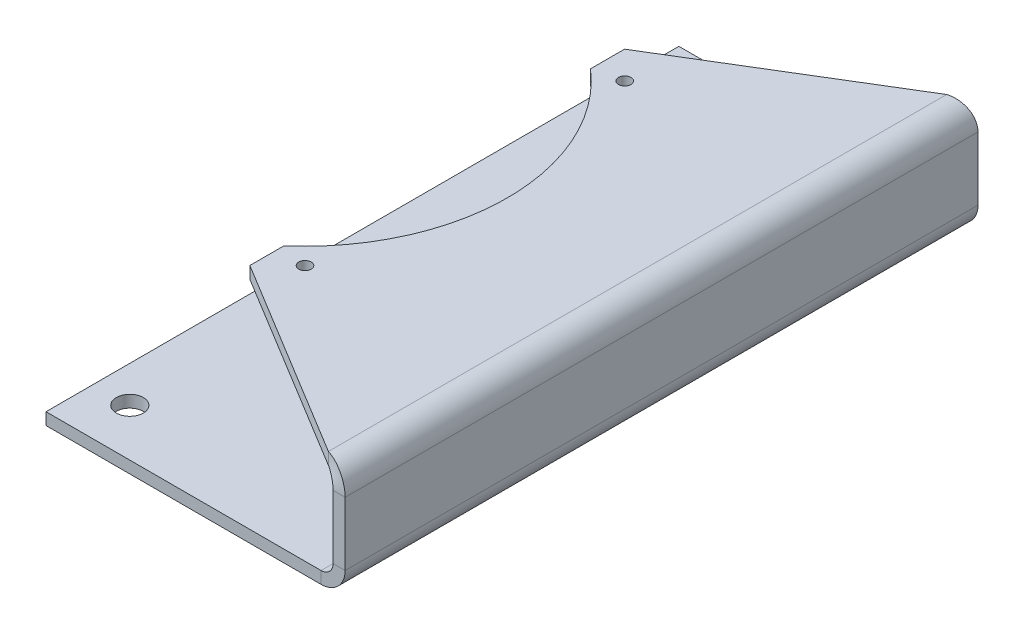
ISO-10303-21;
HEADER;
FILE_DESCRIPTION(('STEP AP214'),'2;1');
FILE_NAME('part.step','',(''),(''),'','','');
FILE_SCHEMA(('AUTOMOTIVE_DESIGN { 1 0 10303 214 1 1 1 1 }'));
ENDSEC;
DATA;
#1=APPLICATION_CONTEXT('core data for automotive mechanical design processes');
#2=APPLICATION_PROTOCOL_DEFINITION('international standard','automotive_design',2000,#1);
#3=PRODUCT_CONTEXT('',#1,'mechanical');
#4=PRODUCT('Part','Part','',(#3));
#5=PRODUCT_RELATED_PRODUCT_CATEGORY('part','',(#4));
#6=PRODUCT_DEFINITION_FORMATION('','',#4);
#7=PRODUCT_DEFINITION_CONTEXT('part definition',#1,'design');
#8=PRODUCT_DEFINITION('design','',#6,#7);
#9=PRODUCT_DEFINITION_SHAPE('','',#8);
#10=(LENGTH_UNIT() NAMED_UNIT(*) SI_UNIT(.MILLI.,.METRE.));
#11=(NAMED_UNIT(*) PLANE_ANGLE_UNIT() SI_UNIT($,.RADIAN.));
#12=(NAMED_UNIT(*) SI_UNIT($,.STERADIAN.) SOLID_ANGLE_UNIT());
#13=UNCERTAINTY_MEASURE_WITH_UNIT(LENGTH_MEASURE(1.E-05),#10,'distance_accuracy_value','');
#14=(GEOMETRIC_REPRESENTATION_CONTEXT(3) GLOBAL_UNCERTAINTY_ASSIGNED_CONTEXT((#13)) GLOBAL_UNIT_ASSIGNED_CONTEXT((#10,
#11,#12)) REPRESENTATION_CONTEXT('',''));
#15=CARTESIAN_POINT('',(0.,0.,0.));
#16=DIRECTION('',(0.,0.,1.));
#17=DIRECTION('',(1.,0.,0.));
#18=AXIS2_PLACEMENT_3D('',#15,#16,#17);
#19=CARTESIAN_POINT('',(381.03809354639,358.924087180332,-231.441727253866));
#20=DIRECTION('',(0.,0.,1.));
#21=DIRECTION('',(0.,-1.,0.));
#22=AXIS2_PLACEMENT_3D('',#19,#20,#21);
#23=PLANE('',#22);
#24=DIRECTION('',(-1.,0.,0.));
#25=VECTOR('',#24,1.);
#26=CARTESIAN_POINT('',(381.03809354639,42.3046070548638,-231.441727253866));
#27=LINE('',#26,#25);
#28=CARTESIAN_POINT('',(386.82809354639,42.3046070548638,-231.441727253866));
#29=VERTEX_POINT('',#28);
#30=CARTESIAN_POINT('',(381.03809354639,42.3046070548638,-231.441727253866));
#31=VERTEX_POINT('',#30);
#32=EDGE_CURVE('E11',#29,#31,#27,.T.);
#33=ORIENTED_EDGE('',*,*,#32,.F.);
#34=DIRECTION('',(0.,1.,0.));
#35=VECTOR('',#34,1.);
#36=CARTESIAN_POINT('',(386.82809354639,358.924087180332,-231.441727253866));
#37=LINE('',#36,#35);
#38=CARTESIAN_POINT('',(386.82809354639,11.761000104,-231.441727253866));
#39=VERTEX_POINT('',#38);
#40=EDGE_CURVE('E103',#29,#39,#37,.F.);
#41=ORIENTED_EDGE('',*,*,#40,.T.);
#42=DIRECTION('',(-1.,0.,0.));
#43=VECTOR('',#42,1.);
#44=CARTESIAN_POINT('',(381.03809354639,11.761000104,-231.441727253866));
#45=LINE('',#44,#43);
#46=CARTESIAN_POINT('',(381.03809354639,11.761000104,-231.441727253866));
#47=VERTEX_POINT('',#46);
#48=EDGE_CURVE('E45',#39,#47,#45,.T.);
#49=ORIENTED_EDGE('',*,*,#48,.T.);
#50=DIRECTION('',(0.,-1.,0.));
#51=VECTOR('',#50,1.);
#52=CARTESIAN_POINT('',(381.03809354639,358.924087180332,-231.441727253866));
#53=LINE('',#52,#51);
#54=EDGE_CURVE('E106',#31,#47,#53,.T.);
#55=ORIENTED_EDGE('',*,*,#54,.F.);
#56=EDGE_LOOP('',(#33,#41,#49,#55));
#57=FACE_BOUND('',#56,.T.);
#58=ADVANCED_FACE('F35',(#57),#23,.F.);
#59=CARTESIAN_POINT('',(375.24809344239,11.761000104,-231.441727253866));
#60=DIRECTION('',(0.,0.,-1.));
#61=DIRECTION('',(-1.,0.,0.));
#62=AXIS2_PLACEMENT_3D('',#59,#60,#61);
#63=PLANE('',#62);
#64=ORIENTED_EDGE('',*,*,#48,.F.);
#65=CARTESIAN_POINT('',(375.24809344239,11.761000104,-231.441727253866));
#66=DIRECTION('',(0.,0.,-1.));
#67=DIRECTION('',(-1.,0.,0.));
#68=AXIS2_PLACEMENT_3D('',#65,#66,#67);
#69=CIRCLE('',#68,11.580000104);
#70=CARTESIAN_POINT('',(375.24809344239,0.180999999999997,-231.441727253866));
#71=VERTEX_POINT('',#70);
#72=EDGE_CURVE('E306',#39,#71,#69,.T.);
#73=ORIENTED_EDGE('',*,*,#72,.T.);
#74=DIRECTION('',(0.,1.,0.));
#75=VECTOR('',#74,1.);
#76=CARTESIAN_POINT('',(375.24809344239,5.971,-231.441727253866));
#77=LINE('',#76,#75);
#78=CARTESIAN_POINT('',(375.24809344239,5.971,-231.441727253866));
#79=VERTEX_POINT('',#78);
#80=EDGE_CURVE('E181',#71,#79,#77,.T.);
#81=ORIENTED_EDGE('',*,*,#80,.T.);
#82=CARTESIAN_POINT('',(375.24809344239,11.761000104,-231.441727253866));
#83=DIRECTION('',(0.,0.,1.));
#84=DIRECTION('',(1.,0.,0.));
#85=AXIS2_PLACEMENT_3D('',#82,#83,#84);
#86=CIRCLE('',#85,5.790000104);
#87=EDGE_CURVE('E203',#47,#79,#86,.F.);
#88=ORIENTED_EDGE('',*,*,#87,.F.);
#89=EDGE_LOOP('',(#64,#73,#81,#88));
#90=FACE_BOUND('',#89,.T.);
#91=ADVANCED_FACE('F204',(#90),#63,.T.);
#92=CARTESIAN_POINT('',(242.762611250868,5.971,-231.441727253866));
#93=DIRECTION('',(0.,0.,1.));
#94=DIRECTION('',(-1.,0.,0.));
#95=AXIS2_PLACEMENT_3D('',#92,#93,#94);
#96=PLANE('',#95);
#97=ORIENTED_EDGE('',*,*,#80,.F.);
#98=DIRECTION('',(1.,0.,0.));
#99=VECTOR('',#98,1.);
#100=CARTESIAN_POINT('',(0.,0.181,-231.441727253866));
#101=LINE('',#100,#99);
#102=CARTESIAN_POINT('',(242.762611250868,0.181,-231.441727253866));
#103=VERTEX_POINT('',#102);
#104=EDGE_CURVE('E152',#71,#103,#101,.F.);
#105=ORIENTED_EDGE('',*,*,#104,.T.);
#106=DIRECTION('',(0.,1.,0.));
#107=VECTOR('',#106,1.);
#108=CARTESIAN_POINT('',(242.762611250868,5.971,-231.441727253866));
#109=LINE('',#108,#107);
#110=CARTESIAN_POINT('',(242.762611250868,5.971,-231.441727253866));
#111=VERTEX_POINT('',#110);
#112=EDGE_CURVE('E178',#103,#111,#109,.T.);
#113=ORIENTED_EDGE('',*,*,#112,.T.);
#114=DIRECTION('',(-1.,0.,0.));
#115=VECTOR('',#114,1.);
#116=CARTESIAN_POINT('',(242.762611250868,5.971,-231.441727253866));
#117=LINE('',#116,#115);
#118=EDGE_CURVE('E226',#79,#111,#117,.T.);
#119=ORIENTED_EDGE('',*,*,#118,.F.);
#120=EDGE_LOOP('',(#97,#105,#113,#119));
#121=FACE_BOUND('',#120,.T.);
#122=ADVANCED_FACE('F325',(#121),#96,.F.);
#123=CARTESIAN_POINT('',(242.762611250868,5.971,73.3582727461337));
#124=DIRECTION('',(1.,0.,0.));
#125=DIRECTION('',(0.,0.,1.));
#126=AXIS2_PLACEMENT_3D('',#123,#124,#125);
#127=PLANE('',#126);
#128=ORIENTED_EDGE('',*,*,#112,.F.);
#129=DIRECTION('',(0.,0.,-1.));
#130=VECTOR('',#129,1.);
#131=CARTESIAN_POINT('',(242.762611250868,0.181,0.));
#132=LINE('',#131,#130);
#133=CARTESIAN_POINT('',(242.762611250868,0.181,73.3582727461337));
#134=VERTEX_POINT('',#133);
#135=EDGE_CURVE('E311',#103,#134,#132,.F.);
#136=ORIENTED_EDGE('',*,*,#135,.T.);
#137=DIRECTION('',(0.,1.,0.));
#138=VECTOR('',#137,1.);
#139=CARTESIAN_POINT('',(242.762611250868,5.971,73.3582727461337));
#140=LINE('',#139,#138);
#141=CARTESIAN_POINT('',(242.762611250868,5.971,73.3582727461337));
#142=VERTEX_POINT('',#141);
#143=EDGE_CURVE('E175',#134,#142,#140,.T.);
#144=ORIENTED_EDGE('',*,*,#143,.T.);
#145=DIRECTION('',(0.,0.,1.));
#146=VECTOR('',#145,1.);
#147=CARTESIAN_POINT('',(242.762611250868,5.971,73.3582727461337));
#148=LINE('',#147,#146);
#149=EDGE_CURVE('E229',#111,#142,#148,.T.);
#150=ORIENTED_EDGE('',*,*,#149,.F.);
#151=EDGE_LOOP('',(#128,#136,#144,#150));
#152=FACE_BOUND('',#151,.T.);
#153=ADVANCED_FACE('F437',(#152),#127,.F.);
#154=CARTESIAN_POINT('',(242.762611250868,5.971,73.3582727461337));
#155=DIRECTION('',(0.,0.,-1.));
#156=DIRECTION('',(1.,0.,0.));
#157=AXIS2_PLACEMENT_3D('',#154,#155,#156);
#158=PLANE('',#157);
#159=ORIENTED_EDGE('',*,*,#143,.F.);
#160=DIRECTION('',(1.,0.,0.));
#161=VECTOR('',#160,1.);
#162=CARTESIAN_POINT('',(0.,0.181,73.3582727461337));
#163=LINE('',#162,#161);
#164=CARTESIAN_POINT('',(375.24809344239,0.181,73.3582727461337));
#165=VERTEX_POINT('',#164);
#166=EDGE_CURVE('E288',#134,#165,#163,.T.);
#167=ORIENTED_EDGE('',*,*,#166,.T.);
#168=DIRECTION('',(0.,1.,0.));
#169=VECTOR('',#168,1.);
#170=CARTESIAN_POINT('',(375.24809344239,5.971,73.3582727461337));
#171=LINE('',#170,#169);
#172=CARTESIAN_POINT('',(375.24809344239,5.971,73.3582727461337));
#173=VERTEX_POINT('',#172);
#174=EDGE_CURVE('E172',#165,#173,#171,.T.);
#175=ORIENTED_EDGE('',*,*,#174,.T.);
#176=DIRECTION('',(1.,0.,0.));
#177=VECTOR('',#176,1.);
#178=CARTESIAN_POINT('',(242.762611250868,5.971,73.3582727461337));
#179=LINE('',#178,#177);
#180=EDGE_CURVE('E238',#142,#173,#179,.T.);
#181=ORIENTED_EDGE('',*,*,#180,.F.);
#182=EDGE_LOOP('',(#159,#167,#175,#181));
#183=FACE_BOUND('',#182,.T.);
#184=ADVANCED_FACE('F433',(#183),#158,.F.);
#185=CARTESIAN_POINT('',(375.24809344239,11.761000104,73.3582727461337));
#186=DIRECTION('',(0.,0.,-1.));
#187=DIRECTION('',(-1.,0.,0.));
#188=AXIS2_PLACEMENT_3D('',#185,#186,#187);
#189=PLANE('',#188);
#190=ORIENTED_EDGE('',*,*,#174,.F.);
#191=CARTESIAN_POINT('',(375.24809344239,11.761000104,73.3582727461337));
#192=DIRECTION('',(0.,0.,-1.));
#193=DIRECTION('',(-1.,0.,0.));
#194=AXIS2_PLACEMENT_3D('',#191,#192,#193);
#195=CIRCLE('',#194,11.580000104);
#196=CARTESIAN_POINT('',(386.82809354639,11.761000104,73.3582727461337));
#197=VERTEX_POINT('',#196);
#198=EDGE_CURVE('E140',#165,#197,#195,.F.);
#199=ORIENTED_EDGE('',*,*,#198,.T.);
#200=DIRECTION('',(-1.,0.,0.));
#201=VECTOR('',#200,1.);
#202=CARTESIAN_POINT('',(381.03809354639,11.761000104,73.3582727461337));
#203=LINE('',#202,#201);
#204=CARTESIAN_POINT('',(381.03809354639,11.761000104,73.3582727461337));
#205=VERTEX_POINT('',#204);
#206=EDGE_CURVE('E169',#197,#205,#203,.T.);
#207=ORIENTED_EDGE('',*,*,#206,.T.);
#208=CARTESIAN_POINT('',(375.24809344239,11.761000104,73.3582727461337));
#209=DIRECTION('',(0.,0.,1.));
#210=DIRECTION('',(1.,0.,0.));
#211=AXIS2_PLACEMENT_3D('',#208,#209,#210);
#212=CIRCLE('',#211,5.790000104);
#213=EDGE_CURVE('E208',#173,#205,#212,.T.);
#214=ORIENTED_EDGE('',*,*,#213,.F.);
#215=EDGE_LOOP('',(#190,#199,#207,#214));
#216=FACE_BOUND('',#215,.T.);
#217=ADVANCED_FACE('F430',(#216),#189,.F.);
#218=CARTESIAN_POINT('',(381.03809354639,358.924087180332,73.3582727461337));
#219=DIRECTION('',(0.,0.,1.));
#220=DIRECTION('',(0.,-1.,0.));
#221=AXIS2_PLACEMENT_3D('',#218,#219,#220);
#222=PLANE('',#221);
#223=ORIENTED_EDGE('',*,*,#206,.F.);
#224=DIRECTION('',(0.,1.,0.));
#225=VECTOR('',#224,1.);
#226=CARTESIAN_POINT('',(386.82809354639,358.924087180332,73.3582727461337));
#227=LINE('',#226,#225);
#228=CARTESIAN_POINT('',(386.82809354639,42.3046070548638,73.3582727461337));
#229=VERTEX_POINT('',#228);
#230=EDGE_CURVE('E134',#229,#197,#227,.F.);
#231=ORIENTED_EDGE('',*,*,#230,.F.);
#232=DIRECTION('',(-1.,0.,0.));
#233=VECTOR('',#232,1.);
#234=CARTESIAN_POINT('',(381.03809354639,42.3046070548638,73.3582727461337));
#235=LINE('',#234,#233);
#236=CARTESIAN_POINT('',(381.03809354639,42.3046070548638,73.3582727461337));
#237=VERTEX_POINT('',#236);
#238=EDGE_CURVE('E166',#229,#237,#235,.T.);
#239=ORIENTED_EDGE('',*,*,#238,.T.);
#240=DIRECTION('',(0.,-1.,0.));
#241=VECTOR('',#240,1.);
#242=CARTESIAN_POINT('',(381.03809354639,358.924087180332,73.3582727461337));
#243=LINE('',#242,#241);
#244=EDGE_CURVE('E200',#237,#205,#243,.T.);
#245=ORIENTED_EDGE('',*,*,#244,.T.);
#246=EDGE_LOOP('',(#223,#231,#239,#245));
#247=FACE_BOUND('',#246,.T.);
#248=ADVANCED_FACE('F336',(#247),#222,.T.);
#249=CARTESIAN_POINT('',(363.66809333839,42.3046070548638,66.3180654465985));
#250=CARTESIAN_POINT('',(365.59809333839,42.3046070548638,66.3180654465985));
#251=CARTESIAN_POINT('',(367.52809333839,42.3046070548638,66.3180654465985));
#252=CARTESIAN_POINT('',(369.45809333839,42.3046070548638,66.3180654465985));
#253=CARTESIAN_POINT('',(363.66809333839,19.1446068468638,66.3180654465985));
#254=CARTESIAN_POINT('',(365.59809333839,23.0046068468638,66.3180654465985));
#255=CARTESIAN_POINT('',(367.52809333839,26.8646068468638,66.3180654465985));
#256=CARTESIAN_POINT('',(369.45809333839,30.7246068468638,66.3180654465985));
#257=CARTESIAN_POINT('',(386.82809354639,19.1446068468638,73.3582727461337));
#258=CARTESIAN_POINT('',(384.89809354639,23.0046068468638,73.3582727461337));
#259=CARTESIAN_POINT('',(382.96809354639,26.8646068468638,73.3582727461337));
#260=CARTESIAN_POINT('',(381.03809354639,30.7246068468638,73.3582727461337));
#261=CARTESIAN_POINT('',(386.82809354639,42.3046070548638,73.3582727461337));
#262=CARTESIAN_POINT('',(384.89809354639,42.3046070548638,73.3582727461337));
#263=CARTESIAN_POINT('',(382.96809354639,42.3046070548638,73.3582727461337));
#264=CARTESIAN_POINT('',(381.03809354639,42.3046070548638,73.3582727461337));
#265=CARTESIAN_POINT('',(386.82809354639,65.4646072628638,73.3582727461337));
#266=CARTESIAN_POINT('',(384.89809354639,61.6046072628638,73.3582727461337));
#267=CARTESIAN_POINT('',(382.96809354639,57.7446072628638,73.3582727461337));
#268=CARTESIAN_POINT('',(381.03809354639,53.8846072628638,73.3582727461337));
#269=CARTESIAN_POINT('',(363.66809333839,65.4646072628638,66.3180654465985));
#270=CARTESIAN_POINT('',(365.59809333839,61.6046072628638,66.3180654465985));
#271=CARTESIAN_POINT('',(367.52809333839,57.7446072628638,66.3180654465985));
#272=CARTESIAN_POINT('',(369.45809333839,53.8846072628638,66.3180654465985));
#273=CARTESIAN_POINT('',(363.66809333839,42.3046070548638,66.3180654465985));
#274=CARTESIAN_POINT('',(365.59809333839,42.3046070548638,66.3180654465985));
#275=CARTESIAN_POINT('',(367.52809333839,42.3046070548638,66.3180654465985));
#276=CARTESIAN_POINT('',(369.45809333839,42.3046070548638,66.3180654465985));
#277=(BOUNDED_SURFACE() B_SPLINE_SURFACE(3,3,((#249,#250,#251,#252),(#253,#254,#255,#256),(#257,
#258,#259,#260),(#261,#262,#263,#264),(#265,#266,#267,#268),(#269,#270,#271,#272),(#273,#274,
#275,#276)),.UNSPECIFIED.,.T.,.F.,.F.) B_SPLINE_SURFACE_WITH_KNOTS((4,3,4),(4,4),(0.,0.5,1.),
(0.,1.),.UNSPECIFIED.) GEOMETRIC_REPRESENTATION_ITEM() RATIONAL_B_SPLINE_SURFACE(((1.,1.,1.,1.),
(0.333333333333333,0.333333333333333,0.333333333333333,0.333333333333333),(0.333333333333333,
0.333333333333333,0.333333333333333,0.333333333333333),(1.,1.,1.,1.),(0.333333333333333,
0.333333333333333,0.333333333333333,0.333333333333333),(0.333333333333333,0.333333333333333,
0.333333333333333,0.333333333333333),(1.,1.,1.,1.))) REPRESENTATION_ITEM('') SURFACE());
#278=CARTESIAN_POINT('',(375.24809344239,42.3046070548638,69.8381690963661));
#279=DIRECTION('',(0.290840659168822,0.,-0.956771504056347));
#280=DIRECTION('',(-0.956771504056347,0.,-0.290840659168822));
#281=AXIS2_PLACEMENT_3D('',#278,#279,#280);
#282=ELLIPSE('',#281,12.1032033823177,11.580000104);
#283=CARTESIAN_POINT('',(375.24809344239,53.8846071588638,69.838169096366));
#284=VERTEX_POINT('',#283);
#285=EDGE_CURVE('E121',#229,#284,#282,.F.);
#286=DIRECTION('',(0.,-1.,0.));
#287=VECTOR('',#286,1.);
#288=CARTESIAN_POINT('',(375.24809344239,48.0946071588638,69.838169096366));
#289=LINE('',#288,#287);
#290=CARTESIAN_POINT('',(375.24809344239,48.0946071588638,69.838169096366));
#291=VERTEX_POINT('',#290);
#292=EDGE_CURVE('E53',#284,#291,#289,.T.);
#293=CARTESIAN_POINT('',(375.24809344239,42.3046070548638,69.8381690963661));
#294=DIRECTION('',(0.519489848299358,0.,-0.854476621982082));
#295=DIRECTION('',(-0.854476621982082,0.,-0.519489848299358));
#296=AXIS2_PLACEMENT_3D('',#293,#294,#295);
#297=ELLIPSE('',#296,6.77607784115762,5.790000104);
#298=EDGE_CURVE('E277',#237,#291,#297,.F.);
#299=ORIENTED_EDGE('',*,*,#238,.F.);
#300=ORIENTED_EDGE('',*,*,#285,.T.);
#301=ORIENTED_EDGE('',*,*,#292,.T.);
#302=ORIENTED_EDGE('',*,*,#298,.F.);
#303=EDGE_LOOP('',(#299,#300,#301,#302));
#304=FACE_BOUND('',#303,.T.);
#305=ADVANCED_FACE('F337',(#304),#277,.T.);
#306=CARTESIAN_POINT('',(381.03809354639,48.0946071588638,73.3582727461337));
#307=DIRECTION('',(0.519489848299358,0.,-0.854476621982082));
#308=DIRECTION('',(0.854476621982082,0.,0.519489848299358));
#309=AXIS2_PLACEMENT_3D('',#306,#307,#308);
#310=PLANE('',#309);
#311=ORIENTED_EDGE('',*,*,#292,.F.);
#312=DIRECTION('',(0.854476621982082,0.,0.519489848299358));
#313=VECTOR('',#312,1.);
#314=CARTESIAN_POINT('',(381.03809354639,53.8846071588638,73.3582727461337));
#315=LINE('',#314,#313);
#316=CARTESIAN_POINT('',(278.774908517625,53.8846071588638,11.1860785508474));
#317=VERTEX_POINT('',#316);
#318=EDGE_CURVE('E295',#317,#284,#315,.T.);
#319=ORIENTED_EDGE('',*,*,#318,.F.);
#320=DIRECTION('',(0.,-1.,0.));
#321=VECTOR('',#320,1.);
#322=CARTESIAN_POINT('',(278.774908517625,48.0946071588638,11.1860785508474));
#323=LINE('',#322,#321);
#324=CARTESIAN_POINT('',(278.774908517625,48.0946071588638,11.1860785508474));
#325=VERTEX_POINT('',#324);
#326=EDGE_CURVE('E162',#317,#325,#323,.T.);
#327=ORIENTED_EDGE('',*,*,#326,.T.);
#328=DIRECTION('',(0.854476621982082,0.,0.519489848299358));
#329=VECTOR('',#328,1.);
#330=CARTESIAN_POINT('',(381.03809354639,48.0946071588638,73.3582727461337));
#331=LINE('',#330,#329);
#332=EDGE_CURVE('E220',#325,#291,#331,.T.);
#333=ORIENTED_EDGE('',*,*,#332,.T.);
#334=EDGE_LOOP('',(#311,#319,#327,#333));
#335=FACE_BOUND('',#334,.T.);
#336=ADVANCED_FACE('F261',(#335),#310,.F.);
#337=CARTESIAN_POINT('',(278.774908517625,48.0946071588638,11.1860785508474));
#338=DIRECTION('',(1.,0.,0.));
#339=DIRECTION('',(0.,0.,1.));
#340=AXIS2_PLACEMENT_3D('',#337,#338,#339);
#341=PLANE('',#340);
#342=ORIENTED_EDGE('',*,*,#326,.F.);
#343=DIRECTION('',(0.,0.,-1.));
#344=VECTOR('',#343,1.);
#345=CARTESIAN_POINT('',(278.774908517625,53.8846071588638,0.));
#346=LINE('',#345,#344);
#347=CARTESIAN_POINT('',(278.774908517625,53.8846071588638,-5.21512655026073));
#348=VERTEX_POINT('',#347);
#349=EDGE_CURVE('E281',#348,#317,#346,.F.);
#350=ORIENTED_EDGE('',*,*,#349,.F.);
#351=DIRECTION('',(0.,-1.,0.));
#352=VECTOR('',#351,1.);
#353=CARTESIAN_POINT('',(278.774908517625,48.0946071588637,-5.21512655026073));
#354=LINE('',#353,#352);
#355=CARTESIAN_POINT('',(278.774908517625,48.0946071588637,-5.21512655026073));
#356=VERTEX_POINT('',#355);
#357=EDGE_CURVE('E159',#348,#356,#354,.T.);
#358=ORIENTED_EDGE('',*,*,#357,.T.);
#359=DIRECTION('',(0.,0.,1.));
#360=VECTOR('',#359,1.);
#361=CARTESIAN_POINT('',(278.774908517625,48.0946071588638,11.1860785508474));
#362=LINE('',#361,#360);
#363=EDGE_CURVE('E215',#356,#325,#362,.T.);
#364=ORIENTED_EDGE('',*,*,#363,.T.);
#365=EDGE_LOOP('',(#342,#350,#358,#364));
#366=FACE_BOUND('',#365,.T.);
#367=ADVANCED_FACE('F413',(#366),#341,.F.);
#368=CARTESIAN_POINT('',(215.08909354639,48.0946071588637,-79.0417272538663));
#369=DIRECTION('',(0.,-1.,0.));
#370=DIRECTION('',(0.,0.,-1.));
#371=AXIS2_PLACEMENT_3D('',#368,#369,#370);
#372=CYLINDRICAL_SURFACE('',#371,97.5000000000001);
#373=ORIENTED_EDGE('',*,*,#357,.F.);
#374=CARTESIAN_POINT('',(215.08909354639,53.8846071588637,-79.0417272538663));
#375=DIRECTION('',(0.,-1.,0.));
#376=DIRECTION('',(0.,0.,-1.));
#377=AXIS2_PLACEMENT_3D('',#374,#375,#376);
#378=CIRCLE('',#377,97.5000000000001);
#379=CARTESIAN_POINT('',(278.774908517625,53.8846071588638,-152.868327957472));
#380=VERTEX_POINT('',#379);
#381=EDGE_CURVE('E291',#348,#380,#378,.F.);
#382=ORIENTED_EDGE('',*,*,#381,.T.);
#383=DIRECTION('',(0.,-1.,0.));
#384=VECTOR('',#383,1.);
#385=CARTESIAN_POINT('',(278.774908517625,48.0946071588637,-152.868327957472));
#386=LINE('',#385,#384);
#387=CARTESIAN_POINT('',(278.774908517625,48.0946071588637,-152.868327957472));
#388=VERTEX_POINT('',#387);
#389=EDGE_CURVE('E156',#380,#388,#386,.T.);
#390=ORIENTED_EDGE('',*,*,#389,.T.);
#391=CARTESIAN_POINT('',(215.08909354639,48.0946071588637,-79.0417272538663));
#392=DIRECTION('',(0.,-1.,0.));
#393=DIRECTION('',(0.,0.,-1.));
#394=AXIS2_PLACEMENT_3D('',#391,#392,#393);
#395=CIRCLE('',#394,97.5000000000001);
#396=EDGE_CURVE('E249',#356,#388,#395,.F.);
#397=ORIENTED_EDGE('',*,*,#396,.F.);
#398=EDGE_LOOP('',(#373,#382,#390,#397));
#399=FACE_BOUND('',#398,.T.);
#400=ADVANCED_FACE('F411',(#399),#372,.F.);
#401=ORIENTED_EDGE('',*,*,#389,.F.);
#402=DIRECTION('',(0.,0.,-1.));
#403=VECTOR('',#402,1.);
#404=CARTESIAN_POINT('',(278.774908517625,53.8846071588638,0.));
#405=LINE('',#404,#403);
#406=CARTESIAN_POINT('',(278.774908517625,53.8846071588638,-169.26953305858));
#407=VERTEX_POINT('',#406);
#408=EDGE_CURVE('E296',#407,#380,#405,.F.);
#409=ORIENTED_EDGE('',*,*,#408,.F.);
#410=DIRECTION('',(0.,-1.,0.));
#411=VECTOR('',#410,1.);
#412=CARTESIAN_POINT('',(278.774908517625,48.0946071588638,-169.26953305858));
#413=LINE('',#412,#411);
#414=CARTESIAN_POINT('',(278.774908517625,48.0946071588638,-169.26953305858));
#415=VERTEX_POINT('',#414);
#416=EDGE_CURVE('E153',#407,#415,#413,.T.);
#417=ORIENTED_EDGE('',*,*,#416,.T.);
#418=EDGE_CURVE('E222',#415,#388,#362,.T.);
#419=ORIENTED_EDGE('',*,*,#418,.T.);
#420=EDGE_LOOP('',(#401,#409,#417,#419));
#421=FACE_BOUND('',#420,.T.);
#422=ADVANCED_FACE('F408',(#421),#341,.F.);
#423=CARTESIAN_POINT('',(278.774908517625,48.0946071588638,-169.26953305858));
#424=DIRECTION('',(0.519489848299358,0.,0.854476621982082));
#425=DIRECTION('',(-0.854476621982082,0.,0.519489848299358));
#426=AXIS2_PLACEMENT_3D('',#423,#424,#425);
#427=PLANE('',#426);
#428=ORIENTED_EDGE('',*,*,#416,.F.);
#429=DIRECTION('',(-0.854476621982082,0.,0.519489848299358));
#430=VECTOR('',#429,1.);
#431=CARTESIAN_POINT('',(278.774908517625,53.8846071588638,-169.26953305858));
#432=LINE('',#431,#430);
#433=CARTESIAN_POINT('',(375.24809344239,53.8846071588638,-227.921623604099));
#434=VERTEX_POINT('',#433);
#435=EDGE_CURVE('E292',#434,#407,#432,.T.);
#436=ORIENTED_EDGE('',*,*,#435,.F.);
#437=DIRECTION('',(0.,-1.,0.));
#438=VECTOR('',#437,1.);
#439=CARTESIAN_POINT('',(375.24809344239,48.0946071588638,-227.921623604099));
#440=LINE('',#439,#438);
#441=CARTESIAN_POINT('',(375.24809344239,48.0946071588638,-227.921623604099));
#442=VERTEX_POINT('',#441);
#443=EDGE_CURVE('E39',#434,#442,#440,.T.);
#444=ORIENTED_EDGE('',*,*,#443,.T.);
#445=DIRECTION('',(-0.854476621982082,0.,0.519489848299358));
#446=VECTOR('',#445,1.);
#447=CARTESIAN_POINT('',(278.774908517625,48.0946071588638,-169.26953305858));
#448=LINE('',#447,#446);
#449=EDGE_CURVE('E252',#442,#415,#448,.T.);
#450=ORIENTED_EDGE('',*,*,#449,.T.);
#451=EDGE_LOOP('',(#428,#436,#444,#450));
#452=FACE_BOUND('',#451,.T.);
#453=ADVANCED_FACE('F370',(#452),#427,.F.);
#454=CARTESIAN_POINT('',(260.26909354639,5.971,-219.281727253866));
#455=DIRECTION('',(0.,1.,0.));
#456=DIRECTION('',(0.,0.,1.));
#457=AXIS2_PLACEMENT_3D('',#454,#455,#456);
#458=CYLINDRICAL_SURFACE('',#457,6.50000000000002);
#459=CARTESIAN_POINT('',(260.26909354639,5.971,-219.281727253866));
#460=DIRECTION('',(0.,1.,0.));
#461=DIRECTION('',(0.,0.,1.));
#462=AXIS2_PLACEMENT_3D('',#459,#460,#461);
#463=CIRCLE('',#462,6.50000000000002);
#464=CARTESIAN_POINT('',(260.26909354639,5.971,-212.781727253866));
#465=VERTEX_POINT('',#464);
#466=EDGE_CURVE('E199',#465,#465,#463,.T.);
#467=ORIENTED_EDGE('',*,*,#466,.T.);
#468=EDGE_LOOP('',(#467));
#469=FACE_BOUND('',#468,.T.);
#470=CARTESIAN_POINT('',(260.26909354639,0.181,-219.281727253866));
#471=DIRECTION('',(0.,1.,0.));
#472=DIRECTION('',(0.,0.,1.));
#473=AXIS2_PLACEMENT_3D('',#470,#471,#472);
#474=CIRCLE('',#473,6.50000000000002);
#475=CARTESIAN_POINT('',(260.26909354639,0.181,-212.781727253866));
#476=VERTEX_POINT('',#475);
#477=EDGE_CURVE('E133',#476,#476,#474,.T.);
#478=ORIENTED_EDGE('',*,*,#477,.F.);
#479=EDGE_LOOP('',(#478));
#480=FACE_BOUND('',#479,.T.);
#481=ADVANCED_FACE('F362',(#469,#480),#458,.F.);
#482=CARTESIAN_POINT('',(260.26909354639,5.971,-73.9617272538663));
#483=DIRECTION('',(0.,1.,0.));
#484=DIRECTION('',(0.,0.,1.));
#485=AXIS2_PLACEMENT_3D('',#482,#483,#484);
#486=CYLINDRICAL_SURFACE('',#485,6.50000000000002);
#487=CARTESIAN_POINT('',(260.26909354639,5.971,-73.9617272538663));
#488=DIRECTION('',(0.,1.,0.));
#489=DIRECTION('',(0.,0.,1.));
#490=AXIS2_PLACEMENT_3D('',#487,#488,#489);
#491=CIRCLE('',#490,6.50000000000002);
#492=CARTESIAN_POINT('',(260.26909354639,5.971,-67.4617272538663));
#493=VERTEX_POINT('',#492);
#494=EDGE_CURVE('E382',#493,#493,#491,.T.);
#495=ORIENTED_EDGE('',*,*,#494,.T.);
#496=EDGE_LOOP('',(#495));
#497=FACE_BOUND('',#496,.T.);
#498=CARTESIAN_POINT('',(260.26909354639,0.181,-73.9617272538663));
#499=DIRECTION('',(0.,1.,0.));
#500=DIRECTION('',(0.,0.,1.));
#501=AXIS2_PLACEMENT_3D('',#498,#499,#500);
#502=CIRCLE('',#501,6.50000000000002);
#503=CARTESIAN_POINT('',(260.26909354639,0.181,-67.4617272538663));
#504=VERTEX_POINT('',#503);
#505=EDGE_CURVE('E146',#504,#504,#502,.T.);
#506=ORIENTED_EDGE('',*,*,#505,.F.);
#507=EDGE_LOOP('',(#506));
#508=FACE_BOUND('',#507,.T.);
#509=ADVANCED_FACE('F369',(#497,#508),#486,.F.);
#510=CARTESIAN_POINT('',(260.26909354639,5.971,50.4982727461337));
#511=DIRECTION('',(0.,1.,0.));
#512=DIRECTION('',(0.,0.,1.));
#513=AXIS2_PLACEMENT_3D('',#510,#511,#512);
#514=CYLINDRICAL_SURFACE('',#513,6.50000000000002);
#515=CARTESIAN_POINT('',(260.26909354639,5.971,50.4982727461337));
#516=DIRECTION('',(0.,1.,0.));
#517=DIRECTION('',(0.,0.,1.));
#518=AXIS2_PLACEMENT_3D('',#515,#516,#517);
#519=CIRCLE('',#518,6.50000000000002);
#520=CARTESIAN_POINT('',(260.26909354639,5.971,56.9982727461337));
#521=VERTEX_POINT('',#520);
#522=EDGE_CURVE('E230',#521,#521,#519,.T.);
#523=ORIENTED_EDGE('',*,*,#522,.T.);
#524=EDGE_LOOP('',(#523));
#525=FACE_BOUND('',#524,.T.);
#526=CARTESIAN_POINT('',(260.26909354639,0.181,50.4982727461337));
#527=DIRECTION('',(0.,1.,0.));
#528=DIRECTION('',(0.,0.,1.));
#529=AXIS2_PLACEMENT_3D('',#526,#527,#528);
#530=CIRCLE('',#529,6.50000000000002);
#531=CARTESIAN_POINT('',(260.26909354639,0.181,56.9982727461337));
#532=VERTEX_POINT('',#531);
#533=EDGE_CURVE('E149',#532,#532,#530,.T.);
#534=ORIENTED_EDGE('',*,*,#533,.F.);
#535=EDGE_LOOP('',(#534));
#536=FACE_BOUND('',#535,.T.);
#537=ADVANCED_FACE('F37',(#525,#536),#514,.F.);
#538=CARTESIAN_POINT('',(292.08909354639,48.0946071588637,-156.041727253866));
#539=DIRECTION('',(0.,-1.,0.));
#540=DIRECTION('',(0.,0.,-1.));
#541=AXIS2_PLACEMENT_3D('',#538,#539,#540);
#542=CYLINDRICAL_SURFACE('',#541,2.99999999999999);
#543=CARTESIAN_POINT('',(292.08909354639,48.0946071588637,-156.041727253866));
#544=DIRECTION('',(0.,-1.,0.));
#545=DIRECTION('',(0.,0.,-1.));
#546=AXIS2_PLACEMENT_3D('',#543,#544,#545);
#547=CIRCLE('',#546,2.99999999999999);
#548=CARTESIAN_POINT('',(292.08909354639,48.0946071588637,-159.041727253866));
#549=VERTEX_POINT('',#548);
#550=EDGE_CURVE('E241',#549,#549,#547,.F.);
#551=ORIENTED_EDGE('',*,*,#550,.F.);
#552=EDGE_LOOP('',(#551));
#553=FACE_BOUND('',#552,.T.);
#554=CARTESIAN_POINT('',(292.08909354639,53.8846071588637,-156.041727253866));
#555=DIRECTION('',(0.,-1.,0.));
#556=DIRECTION('',(0.,0.,-1.));
#557=AXIS2_PLACEMENT_3D('',#554,#555,#556);
#558=CIRCLE('',#557,2.99999999999999);
#559=CARTESIAN_POINT('',(292.08909354639,53.8846071588637,-159.041727253866));
#560=VERTEX_POINT('',#559);
#561=EDGE_CURVE('E284',#560,#560,#558,.F.);
#562=ORIENTED_EDGE('',*,*,#561,.T.);
#563=EDGE_LOOP('',(#562));
#564=FACE_BOUND('',#563,.T.);
#565=ADVANCED_FACE('F377',(#553,#564),#542,.F.);
#566=CARTESIAN_POINT('',(292.08909354639,48.0946071588637,-2.04172725386634));
#567=DIRECTION('',(0.,-1.,0.));
#568=DIRECTION('',(0.,0.,-1.));
#569=AXIS2_PLACEMENT_3D('',#566,#567,#568);
#570=CYLINDRICAL_SURFACE('',#569,2.99999999999999);
#571=CARTESIAN_POINT('',(292.08909354639,48.0946071588637,-2.04172725386634));
#572=DIRECTION('',(0.,-1.,0.));
#573=DIRECTION('',(0.,0.,-1.));
#574=AXIS2_PLACEMENT_3D('',#571,#572,#573);
#575=CIRCLE('',#574,2.99999999999999);
#576=CARTESIAN_POINT('',(292.08909354639,48.0946071588637,-5.04172725386633));
#577=VERTEX_POINT('',#576);
#578=EDGE_CURVE('E246',#577,#577,#575,.F.);
#579=ORIENTED_EDGE('',*,*,#578,.F.);
#580=EDGE_LOOP('',(#579));
#581=FACE_BOUND('',#580,.T.);
#582=CARTESIAN_POINT('',(292.08909354639,53.8846071588637,-2.04172725386634));
#583=DIRECTION('',(0.,-1.,0.));
#584=DIRECTION('',(0.,0.,-1.));
#585=AXIS2_PLACEMENT_3D('',#582,#583,#584);
#586=CIRCLE('',#585,2.99999999999999);
#587=CARTESIAN_POINT('',(292.08909354639,53.8846071588637,-5.04172725386633));
#588=VERTEX_POINT('',#587);
#589=EDGE_CURVE('E287',#588,#588,#586,.F.);
#590=ORIENTED_EDGE('',*,*,#589,.T.);
#591=EDGE_LOOP('',(#590));
#592=FACE_BOUND('',#591,.T.);
#593=ADVANCED_FACE('F361',(#581,#592),#570,.F.);
#594=CARTESIAN_POINT('',(381.03809354639,42.3046070548638,-231.441727253866));
#595=CARTESIAN_POINT('',(382.96809354639,42.3046070548638,-231.441727253866));
#596=CARTESIAN_POINT('',(384.89809354639,42.3046070548638,-231.441727253866));
#597=CARTESIAN_POINT('',(386.82809354639,42.3046070548638,-231.441727253866));
#598=CARTESIAN_POINT('',(381.03809354639,30.7246068468638,-231.441727253866));
#599=CARTESIAN_POINT('',(382.96809354639,26.8646068468638,-231.441727253866));
#600=CARTESIAN_POINT('',(384.89809354639,23.0046068468638,-231.441727253866));
#601=CARTESIAN_POINT('',(386.82809354639,19.1446068468638,-231.441727253866));
#602=CARTESIAN_POINT('',(369.45809333839,30.7246068468638,-224.401519954331));
#603=CARTESIAN_POINT('',(367.52809333839,26.8646068468638,-224.401519954331));
#604=CARTESIAN_POINT('',(365.59809333839,23.0046068468638,-224.401519954331));
#605=CARTESIAN_POINT('',(363.66809333839,19.1446068468638,-224.401519954331));
#606=CARTESIAN_POINT('',(369.45809333839,42.3046070548638,-224.401519954331));
#607=CARTESIAN_POINT('',(367.52809333839,42.3046070548638,-224.401519954331));
#608=CARTESIAN_POINT('',(365.59809333839,42.3046070548638,-224.401519954331));
#609=CARTESIAN_POINT('',(363.66809333839,42.3046070548638,-224.401519954331));
#610=CARTESIAN_POINT('',(369.45809333839,53.8846072628638,-224.401519954331));
#611=CARTESIAN_POINT('',(367.52809333839,57.7446072628638,-224.401519954331));
#612=CARTESIAN_POINT('',(365.59809333839,61.6046072628638,-224.401519954331));
#613=CARTESIAN_POINT('',(363.66809333839,65.4646072628638,-224.401519954331));
#614=CARTESIAN_POINT('',(381.03809354639,53.8846072628638,-231.441727253866));
#615=CARTESIAN_POINT('',(382.96809354639,57.7446072628638,-231.441727253866));
#616=CARTESIAN_POINT('',(384.89809354639,61.6046072628638,-231.441727253866));
#617=CARTESIAN_POINT('',(386.82809354639,65.4646072628638,-231.441727253866));
#618=CARTESIAN_POINT('',(381.03809354639,42.3046070548638,-231.441727253866));
#619=CARTESIAN_POINT('',(382.96809354639,42.3046070548638,-231.441727253866));
#620=CARTESIAN_POINT('',(384.89809354639,42.3046070548638,-231.441727253866));
#621=CARTESIAN_POINT('',(386.82809354639,42.3046070548638,-231.441727253866));
#622=(BOUNDED_SURFACE() B_SPLINE_SURFACE(3,3,((#594,#595,#596,#597),(#598,#599,#600,#601),(#602,
#603,#604,#605),(#606,#607,#608,#609),(#610,#611,#612,#613),(#614,#615,#616,#617),(#618,#619,
#620,#621)),.UNSPECIFIED.,.T.,.F.,.F.) B_SPLINE_SURFACE_WITH_KNOTS((4,3,4),(4,4),(0.,0.5,1.),
(0.,1.),.UNSPECIFIED.) GEOMETRIC_REPRESENTATION_ITEM() RATIONAL_B_SPLINE_SURFACE(((1.,1.,1.,1.),
(0.333333333333333,0.333333333333333,0.333333333333333,0.333333333333333),(0.333333333333333,
0.333333333333333,0.333333333333333,0.333333333333333),(1.,1.,1.,1.),(0.333333333333333,
0.333333333333333,0.333333333333333,0.333333333333333),(0.333333333333333,0.333333333333333,
0.333333333333333,0.333333333333333),(1.,1.,1.,1.))) REPRESENTATION_ITEM('') SURFACE());
#623=CARTESIAN_POINT('',(375.24809344239,42.3046070548638,-227.921623604099));
#624=DIRECTION('',(-0.290840659168823,0.,-0.956771504056347));
#625=DIRECTION('',(0.956771504056347,0.,-0.290840659168823));
#626=AXIS2_PLACEMENT_3D('',#623,#624,#625);
#627=ELLIPSE('',#626,12.1032033823177,11.580000104);
#628=EDGE_CURVE('E119',#434,#29,#627,.T.);
#629=CARTESIAN_POINT('',(375.24809344239,42.3046070548638,-227.921623604099));
#630=DIRECTION('',(-0.519489848299358,0.,-0.854476621982082));
#631=DIRECTION('',(0.854476621982082,0.,-0.519489848299358));
#632=AXIS2_PLACEMENT_3D('',#629,#630,#631);
#633=ELLIPSE('',#632,6.77607784115762,5.790000104);
#634=EDGE_CURVE('E275',#442,#31,#633,.T.);
#635=ORIENTED_EDGE('',*,*,#628,.T.);
#636=ORIENTED_EDGE('',*,*,#32,.T.);
#637=ORIENTED_EDGE('',*,*,#634,.F.);
#638=ORIENTED_EDGE('',*,*,#443,.F.);
#639=EDGE_LOOP('',(#635,#636,#637,#638));
#640=FACE_BOUND('',#639,.T.);
#641=ADVANCED_FACE('F137',(#640),#622,.F.);
#642=CARTESIAN_POINT('',(0.,48.0946071588638,0.));
#643=DIRECTION('',(0.,-1.,0.));
#644=DIRECTION('',(0.,0.,-1.));
#645=AXIS2_PLACEMENT_3D('',#642,#643,#644);
#646=PLANE('',#645);
#647=ORIENTED_EDGE('',*,*,#550,.T.);
#648=EDGE_LOOP('',(#647));
#649=FACE_BOUND('',#648,.T.);
#650=ORIENTED_EDGE('',*,*,#578,.T.);
#651=EDGE_LOOP('',(#650));
#652=FACE_BOUND('',#651,.T.);
#653=ORIENTED_EDGE('',*,*,#449,.F.);
#654=DIRECTION('',(0.,0.,-1.));
#655=VECTOR('',#654,1.);
#656=CARTESIAN_POINT('',(375.24809344239,48.0946071588638,0.));
#657=LINE('',#656,#655);
#658=EDGE_CURVE('E267',#442,#291,#657,.F.);
#659=ORIENTED_EDGE('',*,*,#658,.T.);
#660=ORIENTED_EDGE('',*,*,#332,.F.);
#661=ORIENTED_EDGE('',*,*,#363,.F.);
#662=ORIENTED_EDGE('',*,*,#396,.T.);
#663=ORIENTED_EDGE('',*,*,#418,.F.);
#664=EDGE_LOOP('',(#653,#659,#660,#661,#662,#663));
#665=FACE_BOUND('',#664,.T.);
#666=ADVANCED_FACE('F268',(#649,#652,#665),#646,.T.);
#667=CARTESIAN_POINT('',(0.,5.971,0.));
#668=DIRECTION('',(0.,-1.,0.));
#669=DIRECTION('',(0.,0.,-1.));
#670=AXIS2_PLACEMENT_3D('',#667,#668,#669);
#671=PLANE('',#670);
#672=ORIENTED_EDGE('',*,*,#466,.F.);
#673=EDGE_LOOP('',(#672));
#674=FACE_BOUND('',#673,.T.);
#675=ORIENTED_EDGE('',*,*,#494,.F.);
#676=EDGE_LOOP('',(#675));
#677=FACE_BOUND('',#676,.T.);
#678=ORIENTED_EDGE('',*,*,#522,.F.);
#679=EDGE_LOOP('',(#678));
#680=FACE_BOUND('',#679,.T.);
#681=ORIENTED_EDGE('',*,*,#180,.T.);
#682=DIRECTION('',(0.,0.,1.));
#683=VECTOR('',#682,1.);
#684=CARTESIAN_POINT('',(375.24809344239,5.971,-231.441727253866));
#685=LINE('',#684,#683);
#686=EDGE_CURVE('E214',#173,#79,#685,.F.);
#687=ORIENTED_EDGE('',*,*,#686,.T.);
#688=ORIENTED_EDGE('',*,*,#118,.T.);
#689=ORIENTED_EDGE('',*,*,#149,.T.);
#690=EDGE_LOOP('',(#681,#687,#688,#689));
#691=FACE_BOUND('',#690,.T.);
#692=ADVANCED_FACE('F330',(#674,#677,#680,#691),#671,.F.);
#693=CARTESIAN_POINT('',(381.03809354639,358.924087180332,73.3582727461337));
#694=DIRECTION('',(1.,0.,0.));
#695=DIRECTION('',(0.,0.,-1.));
#696=AXIS2_PLACEMENT_3D('',#693,#694,#695);
#697=PLANE('',#696);
#698=ORIENTED_EDGE('',*,*,#244,.F.);
#699=DIRECTION('',(0.,0.,-1.));
#700=VECTOR('',#699,1.);
#701=CARTESIAN_POINT('',(381.03809354639,42.3046070548638,73.3582727461337));
#702=LINE('',#701,#700);
#703=EDGE_CURVE('E198',#237,#31,#702,.T.);
#704=ORIENTED_EDGE('',*,*,#703,.T.);
#705=ORIENTED_EDGE('',*,*,#54,.T.);
#706=DIRECTION('',(0.,0.,1.));
#707=VECTOR('',#706,1.);
#708=CARTESIAN_POINT('',(381.03809354639,11.761000104,73.3582727461337));
#709=LINE('',#708,#707);
#710=EDGE_CURVE('E196',#47,#205,#709,.T.);
#711=ORIENTED_EDGE('',*,*,#710,.T.);
#712=EDGE_LOOP('',(#698,#704,#705,#711));
#713=FACE_BOUND('',#712,.T.);
#714=ADVANCED_FACE('F194',(#713),#697,.F.);
#715=CARTESIAN_POINT('',(375.24809344239,11.761000104,73.3582727461337));
#716=DIRECTION('',(0.,0.,-1.));
#717=DIRECTION('',(-1.,0.,0.));
#718=AXIS2_PLACEMENT_3D('',#715,#716,#717);
#719=CYLINDRICAL_SURFACE('',#718,5.790000104);
#720=ORIENTED_EDGE('',*,*,#87,.T.);
#721=ORIENTED_EDGE('',*,*,#686,.F.);
#722=ORIENTED_EDGE('',*,*,#213,.T.);
#723=ORIENTED_EDGE('',*,*,#710,.F.);
#724=EDGE_LOOP('',(#720,#721,#722,#723));
#725=FACE_BOUND('',#724,.T.);
#726=ADVANCED_FACE('F211',(#725),#719,.F.);
#727=CARTESIAN_POINT('',(375.24809344239,42.3046070548638,73.3582727461337));
#728=DIRECTION('',(0.,0.,-1.));
#729=DIRECTION('',(-1.,0.,0.));
#730=AXIS2_PLACEMENT_3D('',#727,#728,#729);
#731=CYLINDRICAL_SURFACE('',#730,5.790000104);
#732=ORIENTED_EDGE('',*,*,#298,.T.);
#733=ORIENTED_EDGE('',*,*,#658,.F.);
#734=ORIENTED_EDGE('',*,*,#634,.T.);
#735=ORIENTED_EDGE('',*,*,#703,.F.);
#736=EDGE_LOOP('',(#732,#733,#734,#735));
#737=FACE_BOUND('',#736,.T.);
#738=ADVANCED_FACE('F338',(#737),#731,.F.);
#739=CARTESIAN_POINT('',(0.,53.8846071588638,0.));
#740=DIRECTION('',(0.,-1.,0.));
#741=DIRECTION('',(0.,0.,-1.));
#742=AXIS2_PLACEMENT_3D('',#739,#740,#741);
#743=PLANE('',#742);
#744=ORIENTED_EDGE('',*,*,#561,.F.);
#745=EDGE_LOOP('',(#744));
#746=FACE_BOUND('',#745,.T.);
#747=ORIENTED_EDGE('',*,*,#589,.F.);
#748=EDGE_LOOP('',(#747));
#749=FACE_BOUND('',#748,.T.);
#750=ORIENTED_EDGE('',*,*,#435,.T.);
#751=ORIENTED_EDGE('',*,*,#408,.T.);
#752=ORIENTED_EDGE('',*,*,#381,.F.);
#753=ORIENTED_EDGE('',*,*,#349,.T.);
#754=ORIENTED_EDGE('',*,*,#318,.T.);
#755=DIRECTION('',(0.,0.,-1.));
#756=VECTOR('',#755,1.);
#757=CARTESIAN_POINT('',(375.24809344239,53.8846071588638,0.));
#758=LINE('',#757,#756);
#759=EDGE_CURVE('E125',#434,#284,#758,.F.);
#760=ORIENTED_EDGE('',*,*,#759,.F.);
#761=EDGE_LOOP('',(#750,#751,#752,#753,#754,#760));
#762=FACE_BOUND('',#761,.T.);
#763=ADVANCED_FACE('F340',(#746,#749,#762),#743,.F.);
#764=CARTESIAN_POINT('',(0.,0.181,0.));
#765=DIRECTION('',(0.,-1.,0.));
#766=DIRECTION('',(0.,0.,-1.));
#767=AXIS2_PLACEMENT_3D('',#764,#765,#766);
#768=PLANE('',#767);
#769=ORIENTED_EDGE('',*,*,#477,.T.);
#770=EDGE_LOOP('',(#769));
#771=FACE_BOUND('',#770,.T.);
#772=ORIENTED_EDGE('',*,*,#505,.T.);
#773=EDGE_LOOP('',(#772));
#774=FACE_BOUND('',#773,.T.);
#775=ORIENTED_EDGE('',*,*,#533,.T.);
#776=EDGE_LOOP('',(#775));
#777=FACE_BOUND('',#776,.T.);
#778=ORIENTED_EDGE('',*,*,#166,.F.);
#779=ORIENTED_EDGE('',*,*,#135,.F.);
#780=ORIENTED_EDGE('',*,*,#104,.F.);
#781=DIRECTION('',(0.,0.,-1.));
#782=VECTOR('',#781,1.);
#783=CARTESIAN_POINT('',(375.24809344239,0.181,0.));
#784=LINE('',#783,#782);
#785=EDGE_CURVE('E126',#165,#71,#784,.T.);
#786=ORIENTED_EDGE('',*,*,#785,.F.);
#787=EDGE_LOOP('',(#778,#779,#780,#786));
#788=FACE_BOUND('',#787,.T.);
#789=ADVANCED_FACE('F323',(#771,#774,#777,#788),#768,.T.);
#790=CARTESIAN_POINT('',(386.82809354639,358.924087180332,73.3582727461337));
#791=DIRECTION('',(1.,0.,0.));
#792=DIRECTION('',(0.,0.,-1.));
#793=AXIS2_PLACEMENT_3D('',#790,#791,#792);
#794=PLANE('',#793);
#795=ORIENTED_EDGE('',*,*,#230,.T.);
#796=DIRECTION('',(0.,0.,-1.));
#797=VECTOR('',#796,1.);
#798=CARTESIAN_POINT('',(386.82809354639,11.761000104,73.3582727461337));
#799=LINE('',#798,#797);
#800=EDGE_CURVE('E131',#39,#197,#799,.F.);
#801=ORIENTED_EDGE('',*,*,#800,.F.);
#802=ORIENTED_EDGE('',*,*,#40,.F.);
#803=DIRECTION('',(0.,0.,-1.));
#804=VECTOR('',#803,1.);
#805=CARTESIAN_POINT('',(386.82809354639,42.3046070548638,73.3582727461337));
#806=LINE('',#805,#804);
#807=EDGE_CURVE('E116',#229,#29,#806,.T.);
#808=ORIENTED_EDGE('',*,*,#807,.F.);
#809=EDGE_LOOP('',(#795,#801,#802,#808));
#810=FACE_BOUND('',#809,.T.);
#811=ADVANCED_FACE('F129',(#810),#794,.T.);
#812=CARTESIAN_POINT('',(375.24809344239,11.761000104,73.3582727461337));
#813=DIRECTION('',(0.,0.,-1.));
#814=DIRECTION('',(-1.,0.,0.));
#815=AXIS2_PLACEMENT_3D('',#812,#813,#814);
#816=CYLINDRICAL_SURFACE('',#815,11.580000104);
#817=ORIENTED_EDGE('',*,*,#72,.F.);
#818=ORIENTED_EDGE('',*,*,#800,.T.);
#819=ORIENTED_EDGE('',*,*,#198,.F.);
#820=ORIENTED_EDGE('',*,*,#785,.T.);
#821=EDGE_LOOP('',(#817,#818,#819,#820));
#822=FACE_BOUND('',#821,.T.);
#823=ADVANCED_FACE('F316',(#822),#816,.T.);
#824=CARTESIAN_POINT('',(375.24809344239,42.3046070548638,73.3582727461337));
#825=DIRECTION('',(0.,0.,-1.));
#826=DIRECTION('',(-1.,0.,0.));
#827=AXIS2_PLACEMENT_3D('',#824,#825,#826);
#828=CYLINDRICAL_SURFACE('',#827,11.580000104);
#829=ORIENTED_EDGE('',*,*,#285,.F.);
#830=ORIENTED_EDGE('',*,*,#807,.T.);
#831=ORIENTED_EDGE('',*,*,#628,.F.);
#832=ORIENTED_EDGE('',*,*,#759,.T.);
#833=EDGE_LOOP('',(#829,#830,#831,#832));
#834=FACE_BOUND('',#833,.T.);
#835=ADVANCED_FACE('F117',(#834),#828,.T.);
#836=CLOSED_SHELL('',(#58,#91,#122,#153,#184,#217,#248,#305,#336,#367,#400,#422,#453,#481,#509,
#537,#565,#593,#641,#666,#692,#714,#726,#738,#763,#789,#811,#823,#835));
#837=MANIFOLD_SOLID_BREP('B2',#836);
#838=ADVANCED_BREP_SHAPE_REPRESENTATION('',(#18,#837),#14);
#839=SHAPE_DEFINITION_REPRESENTATION(#9,#838);
ENDSEC;
END-ISO-10303-21;
